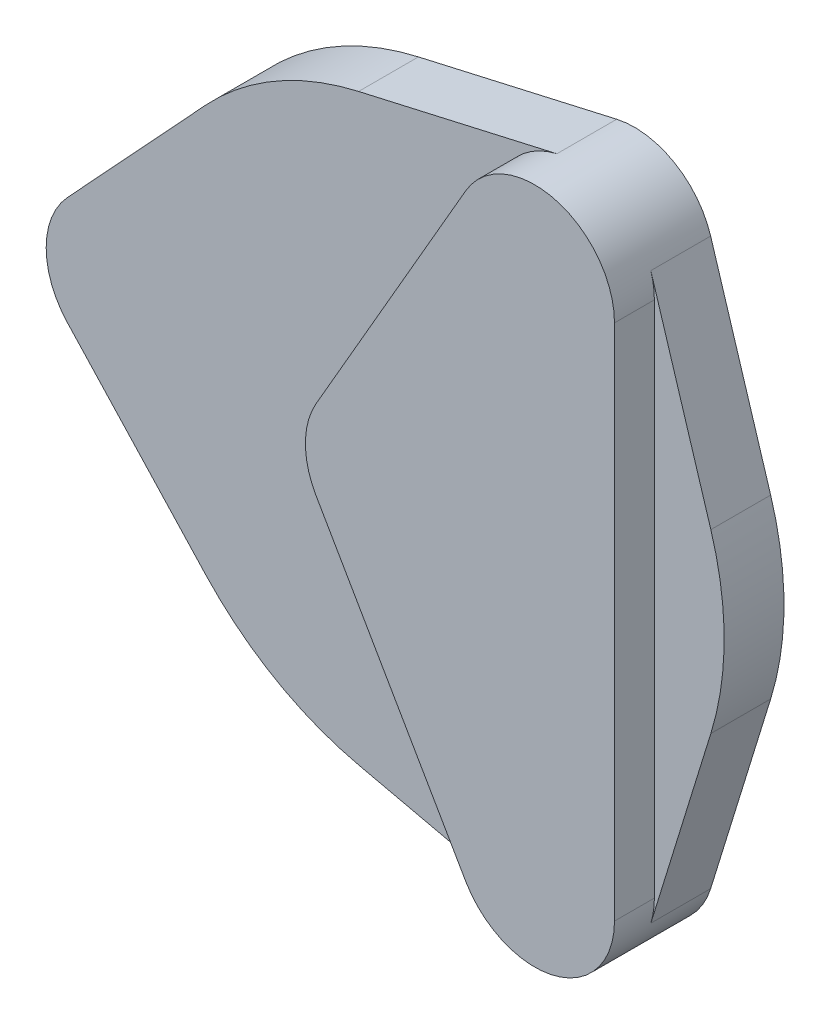
ISO-10303-21;
HEADER;
FILE_DESCRIPTION(('STEP AP214'),'2;1');
FILE_NAME('part.step','',(''),(''),'','','');
FILE_SCHEMA(('AUTOMOTIVE_DESIGN { 1 0 10303 214 1 1 1 1 }'));
ENDSEC;
DATA;
#1=APPLICATION_CONTEXT('core data for automotive mechanical design processes');
#2=APPLICATION_PROTOCOL_DEFINITION('international standard','automotive_design',2000,#1);
#3=PRODUCT_CONTEXT('',#1,'mechanical');
#4=PRODUCT('Part','Part','',(#3));
#5=PRODUCT_RELATED_PRODUCT_CATEGORY('part','',(#4));
#6=PRODUCT_DEFINITION_FORMATION('','',#4);
#7=PRODUCT_DEFINITION_CONTEXT('part definition',#1,'design');
#8=PRODUCT_DEFINITION('design','',#6,#7);
#9=PRODUCT_DEFINITION_SHAPE('','',#8);
#10=(LENGTH_UNIT() NAMED_UNIT(*) SI_UNIT(.MILLI.,.METRE.));
#11=(NAMED_UNIT(*) PLANE_ANGLE_UNIT() SI_UNIT($,.RADIAN.));
#12=(NAMED_UNIT(*) SI_UNIT($,.STERADIAN.) SOLID_ANGLE_UNIT());
#13=UNCERTAINTY_MEASURE_WITH_UNIT(LENGTH_MEASURE(1.E-05),#10,'distance_accuracy_value','');
#14=(GEOMETRIC_REPRESENTATION_CONTEXT(3) GLOBAL_UNCERTAINTY_ASSIGNED_CONTEXT((#13)) GLOBAL_UNIT_ASSIGNED_CONTEXT((#10,
#11,#12)) REPRESENTATION_CONTEXT('',''));
#15=CARTESIAN_POINT('',(0.,0.,0.));
#16=DIRECTION('',(0.,0.,1.));
#17=DIRECTION('',(1.,0.,0.));
#18=AXIS2_PLACEMENT_3D('',#15,#16,#17);
#19=CARTESIAN_POINT('',(-30.,0.,6.));
#20=DIRECTION('',(0.,0.,-1.));
#21=DIRECTION('',(-1.,0.,0.));
#22=AXIS2_PLACEMENT_3D('',#19,#20,#21);
#23=PLANE('',#22);
#24=CARTESIAN_POINT('',(15.0000000000001,-25.9807621135331,6.));
#25=DIRECTION('',(0.,0.,-1.));
#26=DIRECTION('',(-1.,0.,0.));
#27=AXIS2_PLACEMENT_3D('',#24,#25,#26);
#28=CIRCLE('',#27,7.99999999999999);
#29=CARTESIAN_POINT('',(22.6436057953749,-28.3419674084857,6.));
#30=VERTEX_POINT('',#29);
#31=CARTESIAN_POINT('',(23.0000000000001,-25.9807621135331,6.));
#32=VERTEX_POINT('',#31);
#33=EDGE_CURVE('E191',#30,#32,#28,.F.);
#34=ORIENTED_EDGE('',*,*,#33,.F.);
#35=DIRECTION('',(0.295150661869069,0.955450724421857,0.));
#36=VECTOR('',#35,1.);
#37=CARTESIAN_POINT('',(22.6436057953748,-28.3419674084857,6.));
#38=LINE('',#37,#36);
#39=CARTESIAN_POINT('',(28.6635217326557,-8.85451985607207,6.));
#40=VERTEX_POINT('',#39);
#41=EDGE_CURVE('E208',#30,#40,#38,.T.);
#42=ORIENTED_EDGE('',*,*,#41,.T.);
#43=CARTESIAN_POINT('',(0.,0.,6.));
#44=DIRECTION('',(0.,0.,1.));
#45=DIRECTION('',(1.,0.,0.));
#46=AXIS2_PLACEMENT_3D('',#43,#44,#45);
#47=CIRCLE('',#46,30.);
#48=CARTESIAN_POINT('',(28.6635217326557,8.85451985607207,6.));
#49=VERTEX_POINT('',#48);
#50=EDGE_CURVE('E210',#40,#49,#47,.T.);
#51=ORIENTED_EDGE('',*,*,#50,.T.);
#52=DIRECTION('',(-0.295150661869069,0.955450724421857,0.));
#53=VECTOR('',#52,1.);
#54=CARTESIAN_POINT('',(28.6635217326557,8.85451985607208,6.));
#55=LINE('',#54,#53);
#56=CARTESIAN_POINT('',(22.6436057953749,28.3419674084857,6.));
#57=VERTEX_POINT('',#56);
#58=EDGE_CURVE('E212',#49,#57,#55,.T.);
#59=ORIENTED_EDGE('',*,*,#58,.T.);
#60=CARTESIAN_POINT('',(15.0000000000001,25.9807621135331,6.));
#61=DIRECTION('',(0.,0.,-1.));
#62=DIRECTION('',(-1.,0.,0.));
#63=AXIS2_PLACEMENT_3D('',#60,#61,#62);
#64=CIRCLE('',#63,8.);
#65=CARTESIAN_POINT('',(23.0000000000001,25.9807621135331,6.));
#66=VERTEX_POINT('',#65);
#67=EDGE_CURVE('E52',#66,#57,#64,.F.);
#68=ORIENTED_EDGE('',*,*,#67,.F.);
#69=DIRECTION('',(0.,1.,0.));
#70=VECTOR('',#69,1.);
#71=CARTESIAN_POINT('',(23.0000000000001,0.,6.));
#72=LINE('',#71,#70);
#73=EDGE_CURVE('E47',#32,#66,#72,.T.);
#74=ORIENTED_EDGE('',*,*,#73,.F.);
#75=EDGE_LOOP('',(#34,#42,#51,#59,#68,#74));
#76=FACE_BOUND('',#75,.T.);
#77=ADVANCED_FACE('F32',(#76),#23,.F.);
#78=CARTESIAN_POINT('',(8.07179676972464,-29.9807621135331,6.));
#79=VERTEX_POINT('',#78);
#80=CARTESIAN_POINT('',(13.2230608712918,-33.780921556318,6.));
#81=VERTEX_POINT('',#80);
#82=EDGE_CURVE('E193',#79,#81,#28,.F.);
#83=ORIENTED_EDGE('',*,*,#82,.F.);
#84=DIRECTION('',(0.500000000000004,-0.866025403784436,0.));
#85=VECTOR('',#84,1.);
#86=CARTESIAN_POINT('',(-14.4282032302756,8.99038105676662,6.));
#87=LINE('',#86,#85);
#88=CARTESIAN_POINT('',(-6.92820323027549,-4.00000000000003,6.));
#89=VERTEX_POINT('',#88);
#90=EDGE_CURVE('E194',#89,#79,#87,.T.);
#91=ORIENTED_EDGE('',*,*,#90,.F.);
#92=CARTESIAN_POINT('',(0.,0.,6.));
#93=DIRECTION('',(0.,0.,-1.));
#94=DIRECTION('',(-1.,0.,0.));
#95=AXIS2_PLACEMENT_3D('',#92,#93,#94);
#96=CIRCLE('',#95,8.);
#97=CARTESIAN_POINT('',(-6.92820323027549,4.00000000000003,6.));
#98=VERTEX_POINT('',#97);
#99=EDGE_CURVE('E178',#98,#89,#96,.F.);
#100=ORIENTED_EDGE('',*,*,#99,.F.);
#101=DIRECTION('',(-0.500000000000004,-0.866025403784436,0.));
#102=VECTOR('',#101,1.);
#103=CARTESIAN_POINT('',(-14.4282032302756,-8.99038105676662,6.));
#104=LINE('',#103,#102);
#105=CARTESIAN_POINT('',(8.07179676972463,29.9807621135331,6.));
#106=VERTEX_POINT('',#105);
#107=EDGE_CURVE('E179',#106,#98,#104,.T.);
#108=ORIENTED_EDGE('',*,*,#107,.F.);
#109=CARTESIAN_POINT('',(13.2230608712918,33.7809215563179,6.));
#110=VERTEX_POINT('',#109);
#111=EDGE_CURVE('E182',#110,#106,#64,.F.);
#112=ORIENTED_EDGE('',*,*,#111,.F.);
#113=DIRECTION('',(-0.975019930348107,-0.222117391088523,0.));
#114=VECTOR('',#113,1.);
#115=CARTESIAN_POINT('',(13.2230608712918,33.780921556318,6.));
#116=LINE('',#115,#114);
#117=CARTESIAN_POINT('',(-6.66352173265568,29.2505979104432,6.));
#118=VERTEX_POINT('',#117);
#119=EDGE_CURVE('E214',#110,#118,#116,.T.);
#120=ORIENTED_EDGE('',*,*,#119,.T.);
#121=CARTESIAN_POINT('',(0.,0.,6.));
#122=DIRECTION('',(0.,0.,1.));
#123=DIRECTION('',(-1.,0.,0.));
#124=AXIS2_PLACEMENT_3D('',#121,#122,#123);
#125=CIRCLE('',#124,30.);
#126=CARTESIAN_POINT('',(-22.,20.3960780543711,6.));
#127=VERTEX_POINT('',#126);
#128=EDGE_CURVE('E216',#118,#127,#125,.T.);
#129=ORIENTED_EDGE('',*,*,#128,.T.);
#130=DIRECTION('',(-0.679869268479038,-0.733333333333334,0.));
#131=VECTOR('',#130,1.);
#132=CARTESIAN_POINT('',(-22.,20.3960780543711,6.));
#133=LINE('',#132,#131);
#134=CARTESIAN_POINT('',(-35.8666666666667,5.4389541478323,6.));
#135=VERTEX_POINT('',#134);
#136=EDGE_CURVE('E218',#127,#135,#133,.T.);
#137=ORIENTED_EDGE('',*,*,#136,.T.);
#138=CARTESIAN_POINT('',(-30.,0.,6.));
#139=DIRECTION('',(0.,0.,1.));
#140=DIRECTION('',(-1.,0.,0.));
#141=AXIS2_PLACEMENT_3D('',#138,#139,#140);
#142=CIRCLE('',#141,8.);
#143=CARTESIAN_POINT('',(-35.8666666666667,-5.4389541478323,6.));
#144=VERTEX_POINT('',#143);
#145=EDGE_CURVE('E198',#135,#144,#142,.T.);
#146=ORIENTED_EDGE('',*,*,#145,.T.);
#147=DIRECTION('',(0.679869268479038,-0.733333333333333,0.));
#148=VECTOR('',#147,1.);
#149=CARTESIAN_POINT('',(-35.8666666666667,-5.4389541478323,6.));
#150=LINE('',#149,#148);
#151=CARTESIAN_POINT('',(-22.,-20.3960780543711,6.));
#152=VERTEX_POINT('',#151);
#153=EDGE_CURVE('E201',#144,#152,#150,.T.);
#154=ORIENTED_EDGE('',*,*,#153,.T.);
#155=CARTESIAN_POINT('',(0.,0.,6.));
#156=DIRECTION('',(0.,0.,1.));
#157=DIRECTION('',(1.,0.,0.));
#158=AXIS2_PLACEMENT_3D('',#155,#156,#157);
#159=CIRCLE('',#158,30.);
#160=CARTESIAN_POINT('',(-6.66352173265571,-29.2505979104432,6.));
#161=VERTEX_POINT('',#160);
#162=EDGE_CURVE('E204',#152,#161,#159,.T.);
#163=ORIENTED_EDGE('',*,*,#162,.T.);
#164=DIRECTION('',(0.975019930348107,-0.222117391088523,0.));
#165=VECTOR('',#164,1.);
#166=CARTESIAN_POINT('',(-6.66352173265569,-29.2505979104432,6.));
#167=LINE('',#166,#165);
#168=EDGE_CURVE('E206',#161,#81,#167,.T.);
#169=ORIENTED_EDGE('',*,*,#168,.T.);
#170=EDGE_LOOP('',(#83,#91,#100,#108,#112,#120,#129,#137,#146,#154,#163,#169));
#171=FACE_BOUND('',#170,.T.);
#172=ADVANCED_FACE('F295',(#171),#23,.F.);
#173=CARTESIAN_POINT('',(-30.,0.,6.));
#174=DIRECTION('',(0.,0.,-1.));
#175=DIRECTION('',(-1.,0.,0.));
#176=AXIS2_PLACEMENT_3D('',#173,#174,#175);
#177=CYLINDRICAL_SURFACE('',#176,8.);
#178=CARTESIAN_POINT('',(-30.,0.,0.));
#179=DIRECTION('',(0.,0.,1.));
#180=DIRECTION('',(-1.,0.,0.));
#181=AXIS2_PLACEMENT_3D('',#178,#179,#180);
#182=CIRCLE('',#181,8.);
#183=CARTESIAN_POINT('',(-35.8666666666667,5.4389541478323,0.));
#184=VERTEX_POINT('',#183);
#185=CARTESIAN_POINT('',(-35.8666666666667,-5.4389541478323,0.));
#186=VERTEX_POINT('',#185);
#187=EDGE_CURVE('E197',#184,#186,#182,.T.);
#188=ORIENTED_EDGE('',*,*,#187,.T.);
#189=DIRECTION('',(0.,0.,-1.));
#190=VECTOR('',#189,1.);
#191=CARTESIAN_POINT('',(-35.8666666666667,-5.4389541478323,6.));
#192=LINE('',#191,#190);
#193=EDGE_CURVE('E11',#144,#186,#192,.T.);
#194=ORIENTED_EDGE('',*,*,#193,.F.);
#195=ORIENTED_EDGE('',*,*,#145,.F.);
#196=DIRECTION('',(0.,0.,-1.));
#197=VECTOR('',#196,1.);
#198=CARTESIAN_POINT('',(-35.8666666666667,5.4389541478323,6.));
#199=LINE('',#198,#197);
#200=EDGE_CURVE('E220',#135,#184,#199,.T.);
#201=ORIENTED_EDGE('',*,*,#200,.T.);
#202=EDGE_LOOP('',(#188,#194,#195,#201));
#203=FACE_BOUND('',#202,.T.);
#204=ADVANCED_FACE('F34',(#203),#177,.T.);
#205=CARTESIAN_POINT('',(-35.8666666666667,-5.4389541478323,6.));
#206=DIRECTION('',(0.733333333333333,0.679869268479038,0.));
#207=DIRECTION('',(-0.679869268479038,0.733333333333333,0.));
#208=AXIS2_PLACEMENT_3D('',#205,#206,#207);
#209=PLANE('',#208);
#210=DIRECTION('',(0.679869268479038,-0.733333333333333,0.));
#211=VECTOR('',#210,1.);
#212=CARTESIAN_POINT('',(-35.8666666666667,-5.4389541478323,0.));
#213=LINE('',#212,#211);
#214=CARTESIAN_POINT('',(-22.,-20.3960780543711,0.));
#215=VERTEX_POINT('',#214);
#216=EDGE_CURVE('E223',#186,#215,#213,.T.);
#217=ORIENTED_EDGE('',*,*,#216,.T.);
#218=DIRECTION('',(0.,0.,-1.));
#219=VECTOR('',#218,1.);
#220=CARTESIAN_POINT('',(-22.,-20.3960780543711,6.));
#221=LINE('',#220,#219);
#222=EDGE_CURVE('E40',#152,#215,#221,.T.);
#223=ORIENTED_EDGE('',*,*,#222,.F.);
#224=ORIENTED_EDGE('',*,*,#153,.F.);
#225=ORIENTED_EDGE('',*,*,#193,.T.);
#226=EDGE_LOOP('',(#217,#223,#224,#225));
#227=FACE_BOUND('',#226,.T.);
#228=ADVANCED_FACE('F298',(#227),#209,.F.);
#229=CARTESIAN_POINT('',(0.,0.,6.));
#230=DIRECTION('',(0.,0.,-1.));
#231=DIRECTION('',(-1.,0.,0.));
#232=AXIS2_PLACEMENT_3D('',#229,#230,#231);
#233=CYLINDRICAL_SURFACE('',#232,30.);
#234=CARTESIAN_POINT('',(0.,0.,0.));
#235=DIRECTION('',(0.,0.,1.));
#236=DIRECTION('',(1.,0.,0.));
#237=AXIS2_PLACEMENT_3D('',#234,#235,#236);
#238=CIRCLE('',#237,30.);
#239=CARTESIAN_POINT('',(-6.66352173265571,-29.2505979104432,0.));
#240=VERTEX_POINT('',#239);
#241=EDGE_CURVE('E225',#215,#240,#238,.T.);
#242=ORIENTED_EDGE('',*,*,#241,.T.);
#243=DIRECTION('',(0.,0.,-1.));
#244=VECTOR('',#243,1.);
#245=CARTESIAN_POINT('',(-6.66352173265571,-29.2505979104432,6.));
#246=LINE('',#245,#244);
#247=EDGE_CURVE('E270',#161,#240,#246,.T.);
#248=ORIENTED_EDGE('',*,*,#247,.F.);
#249=ORIENTED_EDGE('',*,*,#162,.F.);
#250=ORIENTED_EDGE('',*,*,#222,.T.);
#251=EDGE_LOOP('',(#242,#248,#249,#250));
#252=FACE_BOUND('',#251,.T.);
#253=ADVANCED_FACE('F277',(#252),#233,.T.);
#254=CARTESIAN_POINT('',(-6.66352173265569,-29.2505979104432,6.));
#255=DIRECTION('',(0.222117391088523,0.975019930348107,0.));
#256=DIRECTION('',(-0.975019930348107,0.222117391088523,0.));
#257=AXIS2_PLACEMENT_3D('',#254,#255,#256);
#258=PLANE('',#257);
#259=DIRECTION('',(0.975019930348107,-0.222117391088523,0.));
#260=VECTOR('',#259,1.);
#261=CARTESIAN_POINT('',(-6.66352173265569,-29.2505979104432,0.));
#262=LINE('',#261,#260);
#263=CARTESIAN_POINT('',(13.2230608712918,-33.780921556318,0.));
#264=VERTEX_POINT('',#263);
#265=EDGE_CURVE('E227',#240,#264,#262,.T.);
#266=ORIENTED_EDGE('',*,*,#265,.T.);
#267=DIRECTION('',(0.,0.,-1.));
#268=VECTOR('',#267,1.);
#269=CARTESIAN_POINT('',(13.2230608712918,-33.780921556318,6.));
#270=LINE('',#269,#268);
#271=EDGE_CURVE('E267',#81,#264,#270,.T.);
#272=ORIENTED_EDGE('',*,*,#271,.F.);
#273=ORIENTED_EDGE('',*,*,#168,.F.);
#274=ORIENTED_EDGE('',*,*,#247,.T.);
#275=EDGE_LOOP('',(#266,#272,#273,#274));
#276=FACE_BOUND('',#275,.T.);
#277=ADVANCED_FACE('F288',(#276),#258,.F.);
#278=CARTESIAN_POINT('',(15.0000000000001,-25.9807621135331,6.));
#279=DIRECTION('',(0.,0.,-1.));
#280=DIRECTION('',(-1.,0.,0.));
#281=AXIS2_PLACEMENT_3D('',#278,#279,#280);
#282=CYLINDRICAL_SURFACE('',#281,8.);
#283=CARTESIAN_POINT('',(15.0000000000001,-25.9807621135331,0.));
#284=DIRECTION('',(0.,0.,1.));
#285=DIRECTION('',(-1.,0.,0.));
#286=AXIS2_PLACEMENT_3D('',#283,#284,#285);
#287=CIRCLE('',#286,8.);
#288=CARTESIAN_POINT('',(22.6436057953749,-28.3419674084857,0.));
#289=VERTEX_POINT('',#288);
#290=EDGE_CURVE('E229',#264,#289,#287,.T.);
#291=ORIENTED_EDGE('',*,*,#290,.T.);
#292=DIRECTION('',(0.,0.,-1.));
#293=VECTOR('',#292,1.);
#294=CARTESIAN_POINT('',(22.6436057953749,-28.3419674084857,6.));
#295=LINE('',#294,#293);
#296=EDGE_CURVE('E264',#30,#289,#295,.T.);
#297=ORIENTED_EDGE('',*,*,#296,.F.);
#298=ORIENTED_EDGE('',*,*,#33,.T.);
#299=DIRECTION('',(0.,0.,-1.));
#300=VECTOR('',#299,1.);
#301=CARTESIAN_POINT('',(23.0000000000001,-25.9807621135331,10.));
#302=LINE('',#301,#300);
#303=CARTESIAN_POINT('',(23.0000000000001,-25.9807621135331,10.));
#304=VERTEX_POINT('',#303);
#305=EDGE_CURVE('E184',#304,#32,#302,.T.);
#306=ORIENTED_EDGE('',*,*,#305,.F.);
#307=CARTESIAN_POINT('',(15.0000000000001,-25.9807621135331,10.));
#308=DIRECTION('',(0.,0.,1.));
#309=DIRECTION('',(-1.,0.,0.));
#310=AXIS2_PLACEMENT_3D('',#307,#308,#309);
#311=CIRCLE('',#310,7.99999999999999);
#312=CARTESIAN_POINT('',(8.07179676972463,-29.9807621135331,10.));
#313=VERTEX_POINT('',#312);
#314=EDGE_CURVE('E165',#313,#304,#311,.T.);
#315=ORIENTED_EDGE('',*,*,#314,.F.);
#316=DIRECTION('',(0.,0.,-1.));
#317=VECTOR('',#316,1.);
#318=CARTESIAN_POINT('',(8.07179676972463,-29.9807621135331,10.));
#319=LINE('',#318,#317);
#320=EDGE_CURVE('E162',#313,#79,#319,.T.);
#321=ORIENTED_EDGE('',*,*,#320,.T.);
#322=ORIENTED_EDGE('',*,*,#82,.T.);
#323=ORIENTED_EDGE('',*,*,#271,.T.);
#324=EDGE_LOOP('',(#291,#297,#298,#306,#315,#321,#322,#323));
#325=FACE_BOUND('',#324,.T.);
#326=ADVANCED_FACE('F292',(#325),#282,.T.);
#327=CARTESIAN_POINT('',(22.6436057953748,-28.3419674084857,6.));
#328=DIRECTION('',(-0.955450724421857,0.295150661869069,0.));
#329=DIRECTION('',(-0.295150661869069,-0.955450724421857,0.));
#330=AXIS2_PLACEMENT_3D('',#327,#328,#329);
#331=PLANE('',#330);
#332=DIRECTION('',(0.295150661869069,0.955450724421857,0.));
#333=VECTOR('',#332,1.);
#334=CARTESIAN_POINT('',(22.6436057953748,-28.3419674084857,0.));
#335=LINE('',#334,#333);
#336=CARTESIAN_POINT('',(28.6635217326557,-8.85451985607207,0.));
#337=VERTEX_POINT('',#336);
#338=EDGE_CURVE('E231',#289,#337,#335,.T.);
#339=ORIENTED_EDGE('',*,*,#338,.T.);
#340=DIRECTION('',(0.,0.,-1.));
#341=VECTOR('',#340,1.);
#342=CARTESIAN_POINT('',(28.6635217326557,-8.85451985607207,6.));
#343=LINE('',#342,#341);
#344=EDGE_CURVE('E261',#40,#337,#343,.T.);
#345=ORIENTED_EDGE('',*,*,#344,.F.);
#346=ORIENTED_EDGE('',*,*,#41,.F.);
#347=ORIENTED_EDGE('',*,*,#296,.T.);
#348=EDGE_LOOP('',(#339,#345,#346,#347));
#349=FACE_BOUND('',#348,.T.);
#350=ADVANCED_FACE('F332',(#349),#331,.F.);
#351=CARTESIAN_POINT('',(0.,0.,6.));
#352=DIRECTION('',(0.,0.,-1.));
#353=DIRECTION('',(-1.,0.,0.));
#354=AXIS2_PLACEMENT_3D('',#351,#352,#353);
#355=CYLINDRICAL_SURFACE('',#354,30.);
#356=CARTESIAN_POINT('',(0.,0.,0.));
#357=DIRECTION('',(0.,0.,1.));
#358=DIRECTION('',(1.,0.,0.));
#359=AXIS2_PLACEMENT_3D('',#356,#357,#358);
#360=CIRCLE('',#359,30.);
#361=CARTESIAN_POINT('',(28.6635217326557,8.85451985607207,0.));
#362=VERTEX_POINT('',#361);
#363=EDGE_CURVE('E233',#337,#362,#360,.T.);
#364=ORIENTED_EDGE('',*,*,#363,.T.);
#365=DIRECTION('',(0.,0.,-1.));
#366=VECTOR('',#365,1.);
#367=CARTESIAN_POINT('',(28.6635217326557,8.85451985607207,6.));
#368=LINE('',#367,#366);
#369=EDGE_CURVE('E258',#49,#362,#368,.T.);
#370=ORIENTED_EDGE('',*,*,#369,.F.);
#371=ORIENTED_EDGE('',*,*,#50,.F.);
#372=ORIENTED_EDGE('',*,*,#344,.T.);
#373=EDGE_LOOP('',(#364,#370,#371,#372));
#374=FACE_BOUND('',#373,.T.);
#375=ADVANCED_FACE('F329',(#374),#355,.T.);
#376=CARTESIAN_POINT('',(28.6635217326557,8.85451985607208,6.));
#377=DIRECTION('',(-0.955450724421857,-0.295150661869069,0.));
#378=DIRECTION('',(0.295150661869069,-0.955450724421857,0.));
#379=AXIS2_PLACEMENT_3D('',#376,#377,#378);
#380=PLANE('',#379);
#381=DIRECTION('',(-0.295150661869069,0.955450724421857,0.));
#382=VECTOR('',#381,1.);
#383=CARTESIAN_POINT('',(28.6635217326557,8.85451985607208,0.));
#384=LINE('',#383,#382);
#385=CARTESIAN_POINT('',(22.6436057953749,28.3419674084857,0.));
#386=VERTEX_POINT('',#385);
#387=EDGE_CURVE('E235',#362,#386,#384,.T.);
#388=ORIENTED_EDGE('',*,*,#387,.T.);
#389=DIRECTION('',(0.,0.,-1.));
#390=VECTOR('',#389,1.);
#391=CARTESIAN_POINT('',(22.6436057953749,28.3419674084857,6.));
#392=LINE('',#391,#390);
#393=EDGE_CURVE('E255',#57,#386,#392,.T.);
#394=ORIENTED_EDGE('',*,*,#393,.F.);
#395=ORIENTED_EDGE('',*,*,#58,.F.);
#396=ORIENTED_EDGE('',*,*,#369,.T.);
#397=EDGE_LOOP('',(#388,#394,#395,#396));
#398=FACE_BOUND('',#397,.T.);
#399=ADVANCED_FACE('F325',(#398),#380,.F.);
#400=CARTESIAN_POINT('',(15.0000000000001,25.9807621135331,6.));
#401=DIRECTION('',(0.,0.,-1.));
#402=DIRECTION('',(-1.,0.,0.));
#403=AXIS2_PLACEMENT_3D('',#400,#401,#402);
#404=CYLINDRICAL_SURFACE('',#403,8.);
#405=CARTESIAN_POINT('',(15.0000000000001,25.9807621135331,0.));
#406=DIRECTION('',(0.,0.,1.));
#407=DIRECTION('',(-1.,0.,0.));
#408=AXIS2_PLACEMENT_3D('',#405,#406,#407);
#409=CIRCLE('',#408,8.);
#410=CARTESIAN_POINT('',(13.2230608712918,33.7809215563179,0.));
#411=VERTEX_POINT('',#410);
#412=EDGE_CURVE('E237',#386,#411,#409,.T.);
#413=ORIENTED_EDGE('',*,*,#412,.T.);
#414=DIRECTION('',(0.,0.,-1.));
#415=VECTOR('',#414,1.);
#416=CARTESIAN_POINT('',(13.2230608712918,33.7809215563179,6.));
#417=LINE('',#416,#415);
#418=EDGE_CURVE('E252',#110,#411,#417,.T.);
#419=ORIENTED_EDGE('',*,*,#418,.F.);
#420=ORIENTED_EDGE('',*,*,#111,.T.);
#421=DIRECTION('',(0.,0.,-1.));
#422=VECTOR('',#421,1.);
#423=CARTESIAN_POINT('',(8.07179676972463,29.9807621135331,10.));
#424=LINE('',#423,#422);
#425=CARTESIAN_POINT('',(8.07179676972463,29.9807621135331,10.));
#426=VERTEX_POINT('',#425);
#427=EDGE_CURVE('E342',#426,#106,#424,.T.);
#428=ORIENTED_EDGE('',*,*,#427,.F.);
#429=CARTESIAN_POINT('',(15.0000000000001,25.9807621135331,10.));
#430=DIRECTION('',(0.,0.,1.));
#431=DIRECTION('',(-1.,0.,0.));
#432=AXIS2_PLACEMENT_3D('',#429,#430,#431);
#433=CIRCLE('',#432,8.);
#434=CARTESIAN_POINT('',(23.0000000000001,25.9807621135331,10.));
#435=VERTEX_POINT('',#434);
#436=EDGE_CURVE('E350',#435,#426,#433,.T.);
#437=ORIENTED_EDGE('',*,*,#436,.F.);
#438=DIRECTION('',(0.,0.,-1.));
#439=VECTOR('',#438,1.);
#440=CARTESIAN_POINT('',(23.0000000000001,25.9807621135331,10.));
#441=LINE('',#440,#439);
#442=EDGE_CURVE('E341',#435,#66,#441,.T.);
#443=ORIENTED_EDGE('',*,*,#442,.T.);
#444=ORIENTED_EDGE('',*,*,#67,.T.);
#445=ORIENTED_EDGE('',*,*,#393,.T.);
#446=EDGE_LOOP('',(#413,#419,#420,#428,#437,#443,#444,#445));
#447=FACE_BOUND('',#446,.T.);
#448=ADVANCED_FACE('F320',(#447),#404,.T.);
#449=CARTESIAN_POINT('',(13.2230608712918,33.780921556318,6.));
#450=DIRECTION('',(0.222117391088523,-0.975019930348107,0.));
#451=DIRECTION('',(0.975019930348107,0.222117391088523,0.));
#452=AXIS2_PLACEMENT_3D('',#449,#450,#451);
#453=PLANE('',#452);
#454=DIRECTION('',(-0.975019930348107,-0.222117391088523,0.));
#455=VECTOR('',#454,1.);
#456=CARTESIAN_POINT('',(13.2230608712918,33.780921556318,0.));
#457=LINE('',#456,#455);
#458=CARTESIAN_POINT('',(-6.66352173265568,29.2505979104432,0.));
#459=VERTEX_POINT('',#458);
#460=EDGE_CURVE('E239',#411,#459,#457,.T.);
#461=ORIENTED_EDGE('',*,*,#460,.T.);
#462=DIRECTION('',(0.,0.,-1.));
#463=VECTOR('',#462,1.);
#464=CARTESIAN_POINT('',(-6.66352173265568,29.2505979104432,6.));
#465=LINE('',#464,#463);
#466=EDGE_CURVE('E249',#118,#459,#465,.T.);
#467=ORIENTED_EDGE('',*,*,#466,.F.);
#468=ORIENTED_EDGE('',*,*,#119,.F.);
#469=ORIENTED_EDGE('',*,*,#418,.T.);
#470=EDGE_LOOP('',(#461,#467,#468,#469));
#471=FACE_BOUND('',#470,.T.);
#472=ADVANCED_FACE('F314',(#471),#453,.F.);
#473=CARTESIAN_POINT('',(0.,0.,6.));
#474=DIRECTION('',(0.,0.,-1.));
#475=DIRECTION('',(-1.,0.,0.));
#476=AXIS2_PLACEMENT_3D('',#473,#474,#475);
#477=CYLINDRICAL_SURFACE('',#476,30.);
#478=CARTESIAN_POINT('',(0.,0.,0.));
#479=DIRECTION('',(0.,0.,1.));
#480=DIRECTION('',(-1.,0.,0.));
#481=AXIS2_PLACEMENT_3D('',#478,#479,#480);
#482=CIRCLE('',#481,30.);
#483=CARTESIAN_POINT('',(-22.,20.3960780543711,0.));
#484=VERTEX_POINT('',#483);
#485=EDGE_CURVE('E241',#459,#484,#482,.T.);
#486=ORIENTED_EDGE('',*,*,#485,.T.);
#487=DIRECTION('',(0.,0.,-1.));
#488=VECTOR('',#487,1.);
#489=CARTESIAN_POINT('',(-22.,20.3960780543711,6.));
#490=LINE('',#489,#488);
#491=EDGE_CURVE('E246',#127,#484,#490,.T.);
#492=ORIENTED_EDGE('',*,*,#491,.F.);
#493=ORIENTED_EDGE('',*,*,#128,.F.);
#494=ORIENTED_EDGE('',*,*,#466,.T.);
#495=EDGE_LOOP('',(#486,#492,#493,#494));
#496=FACE_BOUND('',#495,.T.);
#497=ADVANCED_FACE('F310',(#496),#477,.T.);
#498=CARTESIAN_POINT('',(-22.,20.3960780543711,6.));
#499=DIRECTION('',(0.733333333333334,-0.679869268479038,0.));
#500=DIRECTION('',(0.679869268479038,0.733333333333334,0.));
#501=AXIS2_PLACEMENT_3D('',#498,#499,#500);
#502=PLANE('',#501);
#503=DIRECTION('',(-0.679869268479038,-0.733333333333334,0.));
#504=VECTOR('',#503,1.);
#505=CARTESIAN_POINT('',(-22.,20.3960780543711,0.));
#506=LINE('',#505,#504);
#507=EDGE_CURVE('E202',#484,#184,#506,.T.);
#508=ORIENTED_EDGE('',*,*,#507,.T.);
#509=ORIENTED_EDGE('',*,*,#200,.F.);
#510=ORIENTED_EDGE('',*,*,#136,.F.);
#511=ORIENTED_EDGE('',*,*,#491,.T.);
#512=EDGE_LOOP('',(#508,#509,#510,#511));
#513=FACE_BOUND('',#512,.T.);
#514=ADVANCED_FACE('F305',(#513),#502,.F.);
#515=CARTESIAN_POINT('',(-30.,0.,0.));
#516=DIRECTION('',(0.,0.,-1.));
#517=DIRECTION('',(-1.,0.,0.));
#518=AXIS2_PLACEMENT_3D('',#515,#516,#517);
#519=PLANE('',#518);
#520=ORIENTED_EDGE('',*,*,#290,.F.);
#521=ORIENTED_EDGE('',*,*,#265,.F.);
#522=ORIENTED_EDGE('',*,*,#241,.F.);
#523=ORIENTED_EDGE('',*,*,#216,.F.);
#524=ORIENTED_EDGE('',*,*,#187,.F.);
#525=ORIENTED_EDGE('',*,*,#507,.F.);
#526=ORIENTED_EDGE('',*,*,#485,.F.);
#527=ORIENTED_EDGE('',*,*,#460,.F.);
#528=ORIENTED_EDGE('',*,*,#412,.F.);
#529=ORIENTED_EDGE('',*,*,#387,.F.);
#530=ORIENTED_EDGE('',*,*,#363,.F.);
#531=ORIENTED_EDGE('',*,*,#338,.F.);
#532=EDGE_LOOP('',(#520,#521,#522,#523,#524,#525,#526,#527,#528,#529,#530,#531));
#533=FACE_BOUND('',#532,.T.);
#534=ADVANCED_FACE('F283',(#533),#519,.T.);
#535=CARTESIAN_POINT('',(0.,0.,10.));
#536=DIRECTION('',(0.,0.,-1.));
#537=DIRECTION('',(-1.,0.,0.));
#538=AXIS2_PLACEMENT_3D('',#535,#536,#537);
#539=CYLINDRICAL_SURFACE('',#538,8.);
#540=DIRECTION('',(0.,0.,-1.));
#541=VECTOR('',#540,1.);
#542=CARTESIAN_POINT('',(-6.92820323027549,4.00000000000003,10.));
#543=LINE('',#542,#541);
#544=CARTESIAN_POINT('',(-6.92820323027549,4.00000000000003,10.));
#545=VERTEX_POINT('',#544);
#546=EDGE_CURVE('E347',#545,#98,#543,.T.);
#547=ORIENTED_EDGE('',*,*,#546,.T.);
#548=ORIENTED_EDGE('',*,*,#99,.T.);
#549=DIRECTION('',(0.,0.,-1.));
#550=VECTOR('',#549,1.);
#551=CARTESIAN_POINT('',(-6.92820323027549,-4.00000000000003,10.));
#552=LINE('',#551,#550);
#553=CARTESIAN_POINT('',(-6.92820323027549,-4.00000000000003,10.));
#554=VERTEX_POINT('',#553);
#555=EDGE_CURVE('E160',#554,#89,#552,.T.);
#556=ORIENTED_EDGE('',*,*,#555,.F.);
#557=CARTESIAN_POINT('',(0.,0.,10.));
#558=DIRECTION('',(0.,0.,1.));
#559=DIRECTION('',(-1.,0.,0.));
#560=AXIS2_PLACEMENT_3D('',#557,#558,#559);
#561=CIRCLE('',#560,8.);
#562=EDGE_CURVE('E166',#545,#554,#561,.T.);
#563=ORIENTED_EDGE('',*,*,#562,.F.);
#564=EDGE_LOOP('',(#547,#548,#556,#563));
#565=FACE_BOUND('',#564,.T.);
#566=ADVANCED_FACE('F177',(#565),#539,.T.);
#567=CARTESIAN_POINT('',(-6.92820323027549,-4.00000000000003,10.));
#568=DIRECTION('',(0.866025403784436,0.500000000000004,0.));
#569=DIRECTION('',(-0.500000000000004,0.866025403784436,0.));
#570=AXIS2_PLACEMENT_3D('',#567,#568,#569);
#571=PLANE('',#570);
#572=ORIENTED_EDGE('',*,*,#555,.T.);
#573=ORIENTED_EDGE('',*,*,#90,.T.);
#574=ORIENTED_EDGE('',*,*,#320,.F.);
#575=DIRECTION('',(0.500000000000004,-0.866025403784436,0.));
#576=VECTOR('',#575,1.);
#577=CARTESIAN_POINT('',(-6.92820323027549,-4.00000000000003,10.));
#578=LINE('',#577,#576);
#579=EDGE_CURVE('E155',#554,#313,#578,.T.);
#580=ORIENTED_EDGE('',*,*,#579,.F.);
#581=EDGE_LOOP('',(#572,#573,#574,#580));
#582=FACE_BOUND('',#581,.T.);
#583=ADVANCED_FACE('F157',(#582),#571,.F.);
#584=CARTESIAN_POINT('',(23.0000000000001,25.9807621135331,10.));
#585=DIRECTION('',(-1.,0.,0.));
#586=DIRECTION('',(0.,-1.,0.));
#587=AXIS2_PLACEMENT_3D('',#584,#585,#586);
#588=PLANE('',#587);
#589=ORIENTED_EDGE('',*,*,#305,.T.);
#590=ORIENTED_EDGE('',*,*,#73,.T.);
#591=ORIENTED_EDGE('',*,*,#442,.F.);
#592=DIRECTION('',(0.,1.,0.));
#593=VECTOR('',#592,1.);
#594=CARTESIAN_POINT('',(23.0000000000001,25.9807621135331,10.));
#595=LINE('',#594,#593);
#596=EDGE_CURVE('E340',#304,#435,#595,.T.);
#597=ORIENTED_EDGE('',*,*,#596,.F.);
#598=EDGE_LOOP('',(#589,#590,#591,#597));
#599=FACE_BOUND('',#598,.T.);
#600=ADVANCED_FACE('F338',(#599),#588,.F.);
#601=CARTESIAN_POINT('',(8.07179676972463,29.9807621135331,10.));
#602=DIRECTION('',(0.866025403784436,-0.500000000000004,0.));
#603=DIRECTION('',(0.500000000000004,0.866025403784436,0.));
#604=AXIS2_PLACEMENT_3D('',#601,#602,#603);
#605=PLANE('',#604);
#606=ORIENTED_EDGE('',*,*,#427,.T.);
#607=ORIENTED_EDGE('',*,*,#107,.T.);
#608=ORIENTED_EDGE('',*,*,#546,.F.);
#609=DIRECTION('',(-0.500000000000004,-0.866025403784436,0.));
#610=VECTOR('',#609,1.);
#611=CARTESIAN_POINT('',(8.07179676972463,29.9807621135331,10.));
#612=LINE('',#611,#610);
#613=EDGE_CURVE('E171',#426,#545,#612,.T.);
#614=ORIENTED_EDGE('',*,*,#613,.F.);
#615=EDGE_LOOP('',(#606,#607,#608,#614));
#616=FACE_BOUND('',#615,.T.);
#617=ADVANCED_FACE('F356',(#616),#605,.F.);
#618=CARTESIAN_POINT('',(0.,0.,10.));
#619=DIRECTION('',(0.,0.,-1.));
#620=DIRECTION('',(-1.,0.,0.));
#621=AXIS2_PLACEMENT_3D('',#618,#619,#620);
#622=PLANE('',#621);
#623=ORIENTED_EDGE('',*,*,#562,.T.);
#624=ORIENTED_EDGE('',*,*,#579,.T.);
#625=ORIENTED_EDGE('',*,*,#314,.T.);
#626=ORIENTED_EDGE('',*,*,#596,.T.);
#627=ORIENTED_EDGE('',*,*,#436,.T.);
#628=ORIENTED_EDGE('',*,*,#613,.T.);
#629=EDGE_LOOP('',(#623,#624,#625,#626,#627,#628));
#630=FACE_BOUND('',#629,.T.);
#631=ADVANCED_FACE('F169',(#630),#622,.F.);
#632=CLOSED_SHELL('',(#77,#172,#204,#228,#253,#277,#326,#350,#375,#399,#448,#472,#497,#514,#534,
#566,#583,#600,#617,#631));
#633=MANIFOLD_SOLID_BREP('B2',#632);
#634=ADVANCED_BREP_SHAPE_REPRESENTATION('',(#18,#633),#14);
#635=SHAPE_DEFINITION_REPRESENTATION(#9,#634);
ENDSEC;
END-ISO-10303-21;
